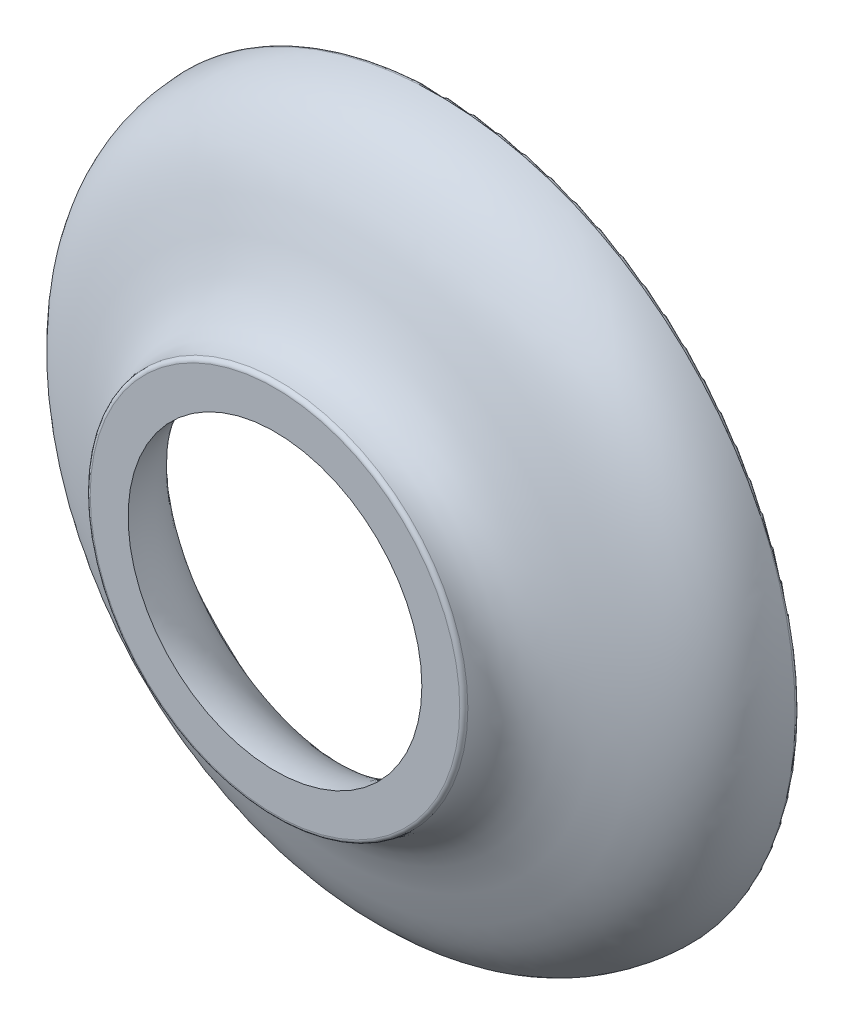
ISO-10303-21;
HEADER;
FILE_DESCRIPTION(('STEP AP214'),'2;1');
FILE_NAME('part.step','',(''),(''),'','','');
FILE_SCHEMA(('AUTOMOTIVE_DESIGN { 1 0 10303 214 1 1 1 1 }'));
ENDSEC;
DATA;
#1=APPLICATION_CONTEXT('core data for automotive mechanical design processes');
#2=APPLICATION_PROTOCOL_DEFINITION('international standard','automotive_design',2000,#1);
#3=PRODUCT_CONTEXT('',#1,'mechanical');
#4=PRODUCT('Part','Part','',(#3));
#5=PRODUCT_RELATED_PRODUCT_CATEGORY('part','',(#4));
#6=PRODUCT_DEFINITION_FORMATION('','',#4);
#7=PRODUCT_DEFINITION_CONTEXT('part definition',#1,'design');
#8=PRODUCT_DEFINITION('design','',#6,#7);
#9=PRODUCT_DEFINITION_SHAPE('','',#8);
#10=(LENGTH_UNIT() NAMED_UNIT(*) SI_UNIT(.MILLI.,.METRE.));
#11=(NAMED_UNIT(*) PLANE_ANGLE_UNIT() SI_UNIT($,.RADIAN.));
#12=(NAMED_UNIT(*) SI_UNIT($,.STERADIAN.) SOLID_ANGLE_UNIT());
#13=UNCERTAINTY_MEASURE_WITH_UNIT(LENGTH_MEASURE(1.E-05),#10,'distance_accuracy_value','');
#14=(GEOMETRIC_REPRESENTATION_CONTEXT(3) GLOBAL_UNCERTAINTY_ASSIGNED_CONTEXT((#13)) GLOBAL_UNIT_ASSIGNED_CONTEXT((#10,
#11,#12)) REPRESENTATION_CONTEXT('',''));
#15=CARTESIAN_POINT('',(0.,0.,0.));
#16=DIRECTION('',(0.,0.,1.));
#17=DIRECTION('',(1.,0.,0.));
#18=AXIS2_PLACEMENT_3D('',#15,#16,#17);
#19=CARTESIAN_POINT('',(-11.0080265945127,-17.3744764167866,25.2010965279296));
#20=DIRECTION('',(0.,0.,1.));
#21=DIRECTION('',(1.,0.,0.));
#22=AXIS2_PLACEMENT_3D('',#19,#20,#21);
#23=PLANE('',#22);
#24=CARTESIAN_POINT('',(-1.83632370109541,-7.9482036215942,25.2010965279296));
#25=DIRECTION('',(0.,0.,1.));
#26=DIRECTION('',(1.,0.,0.));
#27=AXIS2_PLACEMENT_3D('',#24,#25,#26);
#28=CIRCLE('',#27,8.39817044259434);
#29=CARTESIAN_POINT('',(6.56184674149892,-7.9482036215942,25.2010965279296));
#30=VERTEX_POINT('',#29);
#31=EDGE_CURVE('E10',#30,#30,#28,.F.);
#32=ORIENTED_EDGE('',*,*,#31,.T.);
#33=EDGE_LOOP('',(#32));
#34=FACE_BOUND('',#33,.T.);
#35=CARTESIAN_POINT('',(-1.83632370109541,-7.9482036215942,25.2010965279296));
#36=DIRECTION('',(0.,0.,1.));
#37=DIRECTION('',(1.,0.,0.));
#38=AXIS2_PLACEMENT_3D('',#35,#36,#37);
#39=CIRCLE('',#38,7.5);
#40=CARTESIAN_POINT('',(5.66367629890458,-7.9482036215942,25.2010965279296));
#41=VERTEX_POINT('',#40);
#42=EDGE_CURVE('E41',#41,#41,#39,.T.);
#43=ORIENTED_EDGE('',*,*,#42,.T.);
#44=EDGE_LOOP('',(#43));
#45=FACE_BOUND('',#44,.T.);
#46=ADVANCED_FACE('F30',(#34,#45),#23,.F.);
#47=CARTESIAN_POINT('',(-1.83632370109541,-7.9482036215942,29.1010965279297));
#48=DIRECTION('',(0.,0.,1.));
#49=DIRECTION('',(1.,0.,0.));
#50=AXIS2_PLACEMENT_3D('',#47,#48,#49);
#51=TOROIDAL_SURFACE('',#50,4.40315125537648,0.1);
#52=CARTESIAN_POINT('',(-1.83632370109541,-7.9482036215942,29.1074914156458));
#53=DIRECTION('',(0.,0.,1.));
#54=DIRECTION('',(1.,0.,0.));
#55=AXIS2_PLACEMENT_3D('',#52,#53,#54);
#56=CIRCLE('',#55,4.50294657295752);
#57=CARTESIAN_POINT('',(2.6666228718621,-7.9482036215942,29.1074914156458));
#58=VERTEX_POINT('',#57);
#59=EDGE_CURVE('E45',#58,#58,#56,.F.);
#60=ORIENTED_EDGE('',*,*,#59,.F.);
#61=EDGE_LOOP('',(#60));
#62=FACE_BOUND('',#61,.T.);
#63=CARTESIAN_POINT('',(-1.83632370109541,-7.9482036215942,29.2010965279296));
#64=DIRECTION('',(0.,0.,-1.));
#65=DIRECTION('',(-1.,0.,0.));
#66=AXIS2_PLACEMENT_3D('',#63,#64,#65);
#67=CIRCLE('',#66,4.40315125537648);
#68=CARTESIAN_POINT('',(-6.2394749564719,-7.9482036215942,29.2010965279296));
#69=VERTEX_POINT('',#68);
#70=EDGE_CURVE('E50',#69,#69,#67,.F.);
#71=ORIENTED_EDGE('',*,*,#70,.F.);
#72=EDGE_LOOP('',(#71));
#73=FACE_BOUND('',#72,.T.);
#74=ADVANCED_FACE('F68',(#62,#73),#51,.T.);
#75=CARTESIAN_POINT('',(-7.63158480297908,-7.9482036215942,23.2010965279297));
#76=CARTESIAN_POINT('',(-8.33983185359641,-7.9482036215942,23.2010965279297));
#77=CARTESIAN_POINT('',(-10.4254749152642,-7.9482036215942,23.289159495819));
#78=CARTESIAN_POINT('',(-10.2677189319793,-7.9482036215942,28.0467017540626));
#79=CARTESIAN_POINT('',(-6.33632370109542,-7.9482036215942,27.3598275260155));
#80=CARTESIAN_POINT('',(-6.33632370109541,-7.9482036215942,29.2010965279296));
#81=B_SPLINE_CURVE_WITH_KNOTS('',3,(#75,#76,#77,#78,#79,#80),.UNSPECIFIED.,.F.,.F.,(4,1,1,4),
(0.,0.37444393430255,0.47444393430255,1.),.UNSPECIFIED.);
#82=CARTESIAN_POINT('',(-1.83632370109541,-7.9482036215942,29.2010965279296));
#83=DIRECTION('',(0.,0.,1.));
#84=AXIS1_PLACEMENT('',#82,#83);
#85=SURFACE_OF_REVOLUTION('',#81,#84);
#86=CARTESIAN_POINT('',(-1.83632370109541,-7.9482036215942,25.3047491159345));
#87=DIRECTION('',(0.,0.,1.));
#88=DIRECTION('',(1.,0.,0.));
#89=AXIS2_PLACEMENT_3D('',#86,#87,#88);
#90=CIRCLE('',#89,8.49810371333471);
#91=CARTESIAN_POINT('',(6.66178001223929,-7.9482036215942,25.3047491159345));
#92=VERTEX_POINT('',#91);
#93=EDGE_CURVE('E37',#92,#92,#90,.T.);
#94=ORIENTED_EDGE('',*,*,#93,.T.);
#95=EDGE_LOOP('',(#94));
#96=FACE_BOUND('',#95,.T.);
#97=ORIENTED_EDGE('',*,*,#59,.T.);
#98=EDGE_LOOP('',(#97));
#99=FACE_BOUND('',#98,.T.);
#100=ADVANCED_FACE('F62',(#96,#99),#85,.T.);
#101=CARTESIAN_POINT('',(-1.83632370109541,-7.9482036215942,29.2010965279296));
#102=DIRECTION('',(0.,0.,-1.));
#103=DIRECTION('',(-1.,0.,0.));
#104=AXIS2_PLACEMENT_3D('',#101,#102,#103);
#105=PLANE('',#104);
#106=ORIENTED_EDGE('',*,*,#70,.T.);
#107=EDGE_LOOP('',(#106));
#108=FACE_BOUND('',#107,.T.);
#109=CARTESIAN_POINT('',(-1.83632370109541,-7.9482036215942,29.2010965279296));
#110=DIRECTION('',(0.,0.,1.));
#111=DIRECTION('',(1.,0.,0.));
#112=AXIS2_PLACEMENT_3D('',#109,#110,#111);
#113=CIRCLE('',#112,3.5);
#114=CARTESIAN_POINT('',(1.66367629890459,-7.9482036215942,29.2010965279296));
#115=VERTEX_POINT('',#114);
#116=EDGE_CURVE('E53',#115,#115,#113,.T.);
#117=ORIENTED_EDGE('',*,*,#116,.F.);
#118=EDGE_LOOP('',(#117));
#119=FACE_BOUND('',#118,.T.);
#120=ADVANCED_FACE('F67',(#108,#119),#105,.F.);
#121=CARTESIAN_POINT('',(-7.63158480297908,-7.9482036215942,23.2010965279297));
#122=CARTESIAN_POINT('',(-8.33983185359641,-7.9482036215942,23.2010965279297));
#123=CARTESIAN_POINT('',(-10.4254749152642,-7.9482036215942,23.289159495819));
#124=CARTESIAN_POINT('',(-10.2677189319793,-7.9482036215942,28.0467017540626));
#125=CARTESIAN_POINT('',(-6.33632370109542,-7.9482036215942,27.3598275260155));
#126=CARTESIAN_POINT('',(-6.33632370109541,-7.9482036215942,29.2010965279296));
#127=B_SPLINE_CURVE_WITH_KNOTS('',3,(#121,#122,#123,#124,#125,#126),.UNSPECIFIED.,.F.,.F.,(4,1,
1,4),(0.,0.37444393430255,0.47444393430255,1.),.UNSPECIFIED.);
#128=CARTESIAN_POINT('',(-1.83632370109541,-7.9482036215942,29.2010965279296));
#129=DIRECTION('',(0.,0.,1.));
#130=AXIS1_PLACEMENT('',#128,#129);
#131=SURFACE_OF_REVOLUTION('',#127,#130);
#132=OFFSET_SURFACE('',#131,-1.,.F.);
#133=ORIENTED_EDGE('',*,*,#42,.F.);
#134=EDGE_LOOP('',(#133));
#135=FACE_BOUND('',#134,.T.);
#136=ORIENTED_EDGE('',*,*,#116,.T.);
#137=EDGE_LOOP('',(#136));
#138=FACE_BOUND('',#137,.T.);
#139=ADVANCED_FACE('F69',(#135,#138),#132,.F.);
#140=CARTESIAN_POINT('',(-1.83632370109541,-7.9482036215942,25.3010965279297));
#141=DIRECTION('',(0.,0.,1.));
#142=DIRECTION('',(1.,0.,0.));
#143=AXIS2_PLACEMENT_3D('',#140,#141,#142);
#144=TOROIDAL_SURFACE('',#143,8.39817044259434,0.1);
#145=ORIENTED_EDGE('',*,*,#31,.F.);
#146=EDGE_LOOP('',(#145));
#147=FACE_BOUND('',#146,.T.);
#148=ORIENTED_EDGE('',*,*,#93,.F.);
#149=EDGE_LOOP('',(#148));
#150=FACE_BOUND('',#149,.T.);
#151=ADVANCED_FACE('F32',(#147,#150),#144,.T.);
#152=CLOSED_SHELL('',(#46,#74,#100,#120,#139,#151));
#153=MANIFOLD_SOLID_BREP('B2',#152);
#154=ADVANCED_BREP_SHAPE_REPRESENTATION('',(#18,#153),#14);
#155=SHAPE_DEFINITION_REPRESENTATION(#9,#154);
ENDSEC;
END-ISO-10303-21;
